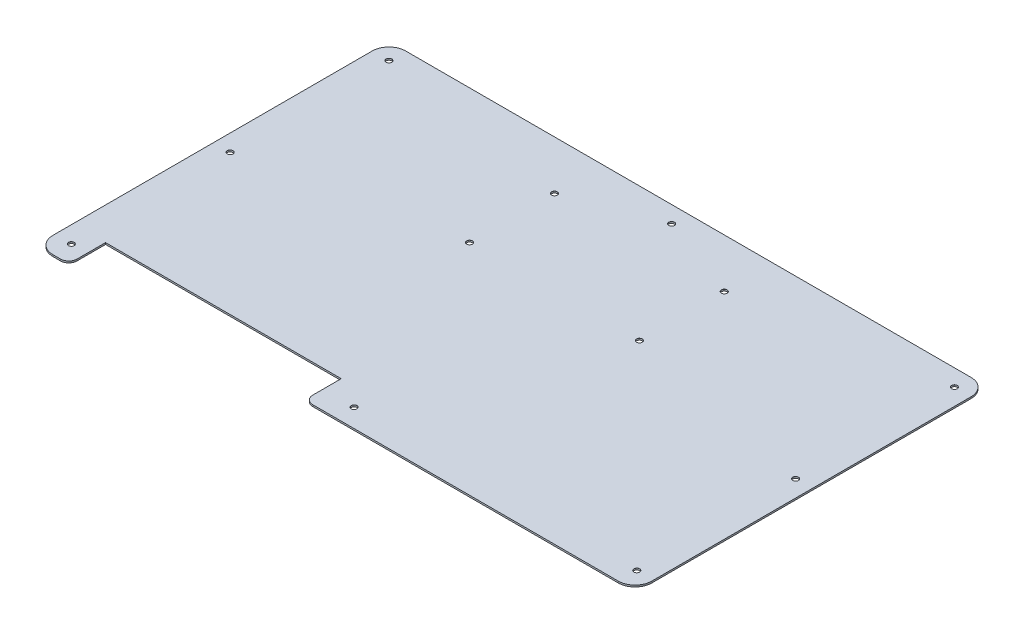
ISO-10303-21;
HEADER;
FILE_DESCRIPTION(('STEP AP214'),'2;1');
FILE_NAME('part.step','',(''),(''),'','','');
FILE_SCHEMA(('AUTOMOTIVE_DESIGN { 1 0 10303 214 1 1 1 1 }'));
ENDSEC;
DATA;
#1=APPLICATION_CONTEXT('core data for automotive mechanical design processes');
#2=APPLICATION_PROTOCOL_DEFINITION('international standard','automotive_design',2000,#1);
#3=PRODUCT_CONTEXT('',#1,'mechanical');
#4=PRODUCT('Part','Part','',(#3));
#5=PRODUCT_RELATED_PRODUCT_CATEGORY('part','',(#4));
#6=PRODUCT_DEFINITION_FORMATION('','',#4);
#7=PRODUCT_DEFINITION_CONTEXT('part definition',#1,'design');
#8=PRODUCT_DEFINITION('design','',#6,#7);
#9=PRODUCT_DEFINITION_SHAPE('','',#8);
#10=(LENGTH_UNIT() NAMED_UNIT(*) SI_UNIT(.MILLI.,.METRE.));
#11=(NAMED_UNIT(*) PLANE_ANGLE_UNIT() SI_UNIT($,.RADIAN.));
#12=(NAMED_UNIT(*) SI_UNIT($,.STERADIAN.) SOLID_ANGLE_UNIT());
#13=UNCERTAINTY_MEASURE_WITH_UNIT(LENGTH_MEASURE(1.E-05),#10,'distance_accuracy_value','');
#14=(GEOMETRIC_REPRESENTATION_CONTEXT(3) GLOBAL_UNCERTAINTY_ASSIGNED_CONTEXT((#13)) GLOBAL_UNIT_ASSIGNED_CONTEXT((#10,
#11,#12)) REPRESENTATION_CONTEXT('',''));
#15=CARTESIAN_POINT('',(0.,0.,0.));
#16=DIRECTION('',(0.,0.,1.));
#17=DIRECTION('',(1.,0.,0.));
#18=AXIS2_PLACEMENT_3D('',#15,#16,#17);
#19=CARTESIAN_POINT('',(-18.635,1.,105.525));
#20=DIRECTION('',(0.,0.,-1.));
#21=DIRECTION('',(-1.,0.,0.));
#22=AXIS2_PLACEMENT_3D('',#19,#20,#21);
#23=PLANE('',#22);
#24=DIRECTION('',(1.,0.,0.));
#25=VECTOR('',#24,1.);
#26=CARTESIAN_POINT('',(-18.635,1.,105.525));
#27=LINE('',#26,#25);
#28=CARTESIAN_POINT('',(-13.635,1.,105.525));
#29=VERTEX_POINT('',#28);
#30=CARTESIAN_POINT('',(169.135,1.,105.525));
#31=VERTEX_POINT('',#30);
#32=EDGE_CURVE('E188',#29,#31,#27,.T.);
#33=ORIENTED_EDGE('',*,*,#32,.F.);
#34=DIRECTION('',(0.,-1.,0.));
#35=VECTOR('',#34,1.);
#36=CARTESIAN_POINT('',(-13.635,1.,105.525));
#37=LINE('',#36,#35);
#38=CARTESIAN_POINT('',(-13.635,0.,105.525));
#39=VERTEX_POINT('',#38);
#40=EDGE_CURVE('E247',#29,#39,#37,.T.);
#41=ORIENTED_EDGE('',*,*,#40,.T.);
#42=DIRECTION('',(1.,0.,0.));
#43=VECTOR('',#42,1.);
#44=CARTESIAN_POINT('',(-18.635,0.,105.525));
#45=LINE('',#44,#43);
#46=CARTESIAN_POINT('',(169.135,0.,105.525));
#47=VERTEX_POINT('',#46);
#48=EDGE_CURVE('E177',#39,#47,#45,.T.);
#49=ORIENTED_EDGE('',*,*,#48,.T.);
#50=DIRECTION('',(0.,-1.,0.));
#51=VECTOR('',#50,1.);
#52=CARTESIAN_POINT('',(169.135,1.,105.525));
#53=LINE('',#52,#51);
#54=EDGE_CURVE('E244',#47,#31,#53,.F.);
#55=ORIENTED_EDGE('',*,*,#54,.T.);
#56=EDGE_LOOP('',(#33,#41,#49,#55));
#57=FACE_BOUND('',#56,.T.);
#58=ADVANCED_FACE('F44',(#57),#23,.F.);
#59=CARTESIAN_POINT('',(179.135,1.,-105.525));
#60=DIRECTION('',(-1.,0.,0.));
#61=DIRECTION('',(0.,0.,1.));
#62=AXIS2_PLACEMENT_3D('',#59,#60,#61);
#63=PLANE('',#62);
#64=DIRECTION('',(0.,0.,-1.));
#65=VECTOR('',#64,1.);
#66=CARTESIAN_POINT('',(179.135,0.,-105.525));
#67=LINE('',#66,#65);
#68=CARTESIAN_POINT('',(179.135,0.,95.525));
#69=VERTEX_POINT('',#68);
#70=CARTESIAN_POINT('',(179.135,0.,-95.525));
#71=VERTEX_POINT('',#70);
#72=EDGE_CURVE('E306',#69,#71,#67,.T.);
#73=ORIENTED_EDGE('',*,*,#72,.T.);
#74=DIRECTION('',(0.,-1.,0.));
#75=VECTOR('',#74,1.);
#76=CARTESIAN_POINT('',(179.135,1.,-95.525));
#77=LINE('',#76,#75);
#78=CARTESIAN_POINT('',(179.135,1.,-95.525));
#79=VERTEX_POINT('',#78);
#80=EDGE_CURVE('E242',#71,#79,#77,.F.);
#81=ORIENTED_EDGE('',*,*,#80,.T.);
#82=DIRECTION('',(0.,0.,-1.));
#83=VECTOR('',#82,1.);
#84=CARTESIAN_POINT('',(179.135,1.,-105.525));
#85=LINE('',#84,#83);
#86=CARTESIAN_POINT('',(179.135,1.,95.525));
#87=VERTEX_POINT('',#86);
#88=EDGE_CURVE('E192',#87,#79,#85,.T.);
#89=ORIENTED_EDGE('',*,*,#88,.F.);
#90=DIRECTION('',(0.,-1.,0.));
#91=VECTOR('',#90,1.);
#92=CARTESIAN_POINT('',(179.135,1.,95.525));
#93=LINE('',#92,#91);
#94=EDGE_CURVE('E239',#87,#69,#93,.T.);
#95=ORIENTED_EDGE('',*,*,#94,.T.);
#96=EDGE_LOOP('',(#73,#81,#89,#95));
#97=FACE_BOUND('',#96,.T.);
#98=ADVANCED_FACE('F302',(#97),#63,.F.);
#99=CARTESIAN_POINT('',(-179.135,1.,-105.525));
#100=DIRECTION('',(0.,0.,1.));
#101=DIRECTION('',(1.,0.,0.));
#102=AXIS2_PLACEMENT_3D('',#99,#100,#101);
#103=PLANE('',#102);
#104=DIRECTION('',(-1.,0.,0.));
#105=VECTOR('',#104,1.);
#106=CARTESIAN_POINT('',(-179.135,0.,-105.525));
#107=LINE('',#106,#105);
#108=CARTESIAN_POINT('',(169.135,0.,-105.525));
#109=VERTEX_POINT('',#108);
#110=CARTESIAN_POINT('',(-169.135,0.,-105.525));
#111=VERTEX_POINT('',#110);
#112=EDGE_CURVE('E308',#109,#111,#107,.T.);
#113=ORIENTED_EDGE('',*,*,#112,.T.);
#114=DIRECTION('',(0.,-1.,0.));
#115=VECTOR('',#114,1.);
#116=CARTESIAN_POINT('',(-169.135,1.,-105.525));
#117=LINE('',#116,#115);
#118=CARTESIAN_POINT('',(-169.135,1.,-105.525));
#119=VERTEX_POINT('',#118);
#120=EDGE_CURVE('E291',#111,#119,#117,.F.);
#121=ORIENTED_EDGE('',*,*,#120,.T.);
#122=DIRECTION('',(-1.,0.,0.));
#123=VECTOR('',#122,1.);
#124=CARTESIAN_POINT('',(-179.135,1.,-105.525));
#125=LINE('',#124,#123);
#126=CARTESIAN_POINT('',(169.135,1.,-105.525));
#127=VERTEX_POINT('',#126);
#128=EDGE_CURVE('E200',#127,#119,#125,.T.);
#129=ORIENTED_EDGE('',*,*,#128,.F.);
#130=DIRECTION('',(0.,-1.,0.));
#131=VECTOR('',#130,1.);
#132=CARTESIAN_POINT('',(169.135,1.,-105.525));
#133=LINE('',#132,#131);
#134=EDGE_CURVE('E288',#127,#109,#133,.T.);
#135=ORIENTED_EDGE('',*,*,#134,.T.);
#136=EDGE_LOOP('',(#113,#121,#129,#135));
#137=FACE_BOUND('',#136,.T.);
#138=ADVANCED_FACE('F330',(#137),#103,.F.);
#139=CARTESIAN_POINT('',(-179.135,1.,-105.525));
#140=DIRECTION('',(1.,0.,0.));
#141=DIRECTION('',(0.,0.,-1.));
#142=AXIS2_PLACEMENT_3D('',#139,#140,#141);
#143=PLANE('',#142);
#144=DIRECTION('',(0.,0.,1.));
#145=VECTOR('',#144,1.);
#146=CARTESIAN_POINT('',(-179.135,1.,-105.525));
#147=LINE('',#146,#145);
#148=CARTESIAN_POINT('',(-179.135,1.,-95.525));
#149=VERTEX_POINT('',#148);
#150=CARTESIAN_POINT('',(-179.135,1.,95.525));
#151=VERTEX_POINT('',#150);
#152=EDGE_CURVE('E205',#149,#151,#147,.T.);
#153=ORIENTED_EDGE('',*,*,#152,.F.);
#154=DIRECTION('',(0.,-1.,0.));
#155=VECTOR('',#154,1.);
#156=CARTESIAN_POINT('',(-179.135,1.,-95.525));
#157=LINE('',#156,#155);
#158=CARTESIAN_POINT('',(-179.135,0.,-95.525));
#159=VERTEX_POINT('',#158);
#160=EDGE_CURVE('E277',#149,#159,#157,.T.);
#161=ORIENTED_EDGE('',*,*,#160,.T.);
#162=DIRECTION('',(0.,0.,1.));
#163=VECTOR('',#162,1.);
#164=CARTESIAN_POINT('',(-179.135,0.,-105.525));
#165=LINE('',#164,#163);
#166=CARTESIAN_POINT('',(-179.135,0.,95.525));
#167=VERTEX_POINT('',#166);
#168=EDGE_CURVE('E269',#159,#167,#165,.T.);
#169=ORIENTED_EDGE('',*,*,#168,.T.);
#170=DIRECTION('',(0.,-1.,0.));
#171=VECTOR('',#170,1.);
#172=CARTESIAN_POINT('',(-179.135,1.,95.525));
#173=LINE('',#172,#171);
#174=EDGE_CURVE('E162',#167,#151,#173,.F.);
#175=ORIENTED_EDGE('',*,*,#174,.T.);
#176=EDGE_LOOP('',(#153,#161,#169,#175));
#177=FACE_BOUND('',#176,.T.);
#178=ADVANCED_FACE('F313',(#177),#143,.F.);
#179=CARTESIAN_POINT('',(-179.135,1.,105.525));
#180=DIRECTION('',(0.,0.,-1.));
#181=DIRECTION('',(-1.,0.,0.));
#182=AXIS2_PLACEMENT_3D('',#179,#180,#181);
#183=PLANE('',#182);
#184=DIRECTION('',(1.,0.,0.));
#185=VECTOR('',#184,1.);
#186=CARTESIAN_POINT('',(-179.135,0.,105.525));
#187=LINE('',#186,#185);
#188=CARTESIAN_POINT('',(-169.135,0.,105.525));
#189=VERTEX_POINT('',#188);
#190=CARTESIAN_POINT('',(-164.635,0.,105.525));
#191=VERTEX_POINT('',#190);
#192=EDGE_CURVE('E266',#189,#191,#187,.T.);
#193=ORIENTED_EDGE('',*,*,#192,.T.);
#194=DIRECTION('',(0.,-1.,0.));
#195=VECTOR('',#194,1.);
#196=CARTESIAN_POINT('',(-164.635,1.,105.525));
#197=LINE('',#196,#195);
#198=CARTESIAN_POINT('',(-164.635,1.,105.525));
#199=VERTEX_POINT('',#198);
#200=EDGE_CURVE('E12',#191,#199,#197,.F.);
#201=ORIENTED_EDGE('',*,*,#200,.T.);
#202=DIRECTION('',(1.,0.,0.));
#203=VECTOR('',#202,1.);
#204=CARTESIAN_POINT('',(-179.135,1.,105.525));
#205=LINE('',#204,#203);
#206=CARTESIAN_POINT('',(-169.135,1.,105.525));
#207=VERTEX_POINT('',#206);
#208=EDGE_CURVE('E153',#207,#199,#205,.T.);
#209=ORIENTED_EDGE('',*,*,#208,.F.);
#210=DIRECTION('',(0.,-1.,0.));
#211=VECTOR('',#210,1.);
#212=CARTESIAN_POINT('',(-169.135,1.,105.525));
#213=LINE('',#212,#211);
#214=EDGE_CURVE('E229',#207,#189,#213,.T.);
#215=ORIENTED_EDGE('',*,*,#214,.T.);
#216=EDGE_LOOP('',(#193,#201,#209,#215));
#217=FACE_BOUND('',#216,.T.);
#218=ADVANCED_FACE('F314',(#217),#183,.F.);
#219=CARTESIAN_POINT('',(-159.635,1.,105.525));
#220=DIRECTION('',(-1.,0.,0.));
#221=DIRECTION('',(0.,0.,1.));
#222=AXIS2_PLACEMENT_3D('',#219,#220,#221);
#223=PLANE('',#222);
#224=DIRECTION('',(0.,0.,-1.));
#225=VECTOR('',#224,1.);
#226=CARTESIAN_POINT('',(-159.635,1.,105.525));
#227=LINE('',#226,#225);
#228=CARTESIAN_POINT('',(-159.635,1.,100.525));
#229=VERTEX_POINT('',#228);
#230=CARTESIAN_POINT('',(-159.635,1.,83.525));
#231=VERTEX_POINT('',#230);
#232=EDGE_CURVE('E142',#229,#231,#227,.T.);
#233=ORIENTED_EDGE('',*,*,#232,.F.);
#234=DIRECTION('',(0.,-1.,0.));
#235=VECTOR('',#234,1.);
#236=CARTESIAN_POINT('',(-159.635,1.,100.525));
#237=LINE('',#236,#235);
#238=CARTESIAN_POINT('',(-159.635,0.,100.525));
#239=VERTEX_POINT('',#238);
#240=EDGE_CURVE('E52',#229,#239,#237,.T.);
#241=ORIENTED_EDGE('',*,*,#240,.T.);
#242=DIRECTION('',(0.,0.,-1.));
#243=VECTOR('',#242,1.);
#244=CARTESIAN_POINT('',(-159.635,0.,105.525));
#245=LINE('',#244,#243);
#246=CARTESIAN_POINT('',(-159.635,0.,83.525));
#247=VERTEX_POINT('',#246);
#248=EDGE_CURVE('E159',#239,#247,#245,.T.);
#249=ORIENTED_EDGE('',*,*,#248,.T.);
#250=DIRECTION('',(0.,-1.,0.));
#251=VECTOR('',#250,1.);
#252=CARTESIAN_POINT('',(-159.635,1.,83.525));
#253=LINE('',#252,#251);
#254=EDGE_CURVE('E156',#231,#247,#253,.T.);
#255=ORIENTED_EDGE('',*,*,#254,.F.);
#256=EDGE_LOOP('',(#233,#241,#249,#255));
#257=FACE_BOUND('',#256,.T.);
#258=ADVANCED_FACE('F157',(#257),#223,.F.);
#259=CARTESIAN_POINT('',(-159.635,1.,83.525));
#260=DIRECTION('',(0.,0.,-1.));
#261=DIRECTION('',(-1.,0.,0.));
#262=AXIS2_PLACEMENT_3D('',#259,#260,#261);
#263=PLANE('',#262);
#264=DIRECTION('',(1.,0.,0.));
#265=VECTOR('',#264,1.);
#266=CARTESIAN_POINT('',(-159.635,0.,83.525));
#267=LINE('',#266,#265);
#268=CARTESIAN_POINT('',(-18.635,0.,83.525));
#269=VERTEX_POINT('',#268);
#270=EDGE_CURVE('E265',#247,#269,#267,.T.);
#271=ORIENTED_EDGE('',*,*,#270,.T.);
#272=DIRECTION('',(0.,-1.,0.));
#273=VECTOR('',#272,1.);
#274=CARTESIAN_POINT('',(-18.635,1.,83.525));
#275=LINE('',#274,#273);
#276=CARTESIAN_POINT('',(-18.635,1.,83.525));
#277=VERTEX_POINT('',#276);
#278=EDGE_CURVE('E163',#277,#269,#275,.T.);
#279=ORIENTED_EDGE('',*,*,#278,.F.);
#280=DIRECTION('',(1.,0.,0.));
#281=VECTOR('',#280,1.);
#282=CARTESIAN_POINT('',(-159.635,1.,83.525));
#283=LINE('',#282,#281);
#284=EDGE_CURVE('E147',#231,#277,#283,.T.);
#285=ORIENTED_EDGE('',*,*,#284,.F.);
#286=ORIENTED_EDGE('',*,*,#254,.T.);
#287=EDGE_LOOP('',(#271,#279,#285,#286));
#288=FACE_BOUND('',#287,.T.);
#289=ADVANCED_FACE('F165',(#288),#263,.F.);
#290=CARTESIAN_POINT('',(-18.635,1.,83.525));
#291=DIRECTION('',(1.,0.,0.));
#292=DIRECTION('',(0.,0.,-1.));
#293=AXIS2_PLACEMENT_3D('',#290,#291,#292);
#294=PLANE('',#293);
#295=DIRECTION('',(0.,0.,1.));
#296=VECTOR('',#295,1.);
#297=CARTESIAN_POINT('',(-18.635,0.,83.525));
#298=LINE('',#297,#296);
#299=CARTESIAN_POINT('',(-18.635,0.,100.525));
#300=VERTEX_POINT('',#299);
#301=EDGE_CURVE('E193',#269,#300,#298,.T.);
#302=ORIENTED_EDGE('',*,*,#301,.T.);
#303=DIRECTION('',(0.,-1.,0.));
#304=VECTOR('',#303,1.);
#305=CARTESIAN_POINT('',(-18.635,1.,100.525));
#306=LINE('',#305,#304);
#307=CARTESIAN_POINT('',(-18.635,1.,100.525));
#308=VERTEX_POINT('',#307);
#309=EDGE_CURVE('E254',#300,#308,#306,.F.);
#310=ORIENTED_EDGE('',*,*,#309,.T.);
#311=DIRECTION('',(0.,0.,1.));
#312=VECTOR('',#311,1.);
#313=CARTESIAN_POINT('',(-18.635,1.,83.525));
#314=LINE('',#313,#312);
#315=EDGE_CURVE('E169',#277,#308,#314,.T.);
#316=ORIENTED_EDGE('',*,*,#315,.F.);
#317=ORIENTED_EDGE('',*,*,#278,.T.);
#318=EDGE_LOOP('',(#302,#310,#316,#317));
#319=FACE_BOUND('',#318,.T.);
#320=ADVANCED_FACE('F364',(#319),#294,.F.);
#321=CARTESIAN_POINT('',(0.,1.,0.));
#322=DIRECTION('',(0.,-1.,0.));
#323=DIRECTION('',(0.,0.,-1.));
#324=AXIS2_PLACEMENT_3D('',#321,#322,#323);
#325=PLANE('',#324);
#326=CARTESIAN_POINT('',(50.8,1.,-76.2));
#327=DIRECTION('',(0.,1.,0.));
#328=DIRECTION('',(0.,0.,1.));
#329=AXIS2_PLACEMENT_3D('',#326,#327,#328);
#330=CIRCLE('',#329,1.725);
#331=CARTESIAN_POINT('',(50.8,1.,-74.475));
#332=VERTEX_POINT('',#331);
#333=EDGE_CURVE('E705',#332,#332,#330,.T.);
#334=ORIENTED_EDGE('',*,*,#333,.F.);
#335=EDGE_LOOP('',(#334));
#336=FACE_BOUND('',#335,.T.);
#337=CARTESIAN_POINT('',(-50.8,1.,-25.4));
#338=DIRECTION('',(0.,1.,0.));
#339=DIRECTION('',(0.,0.,1.));
#340=AXIS2_PLACEMENT_3D('',#337,#338,#339);
#341=CIRCLE('',#340,1.725);
#342=CARTESIAN_POINT('',(-50.8,1.,-23.675));
#343=VERTEX_POINT('',#342);
#344=EDGE_CURVE('E719',#343,#343,#341,.T.);
#345=ORIENTED_EDGE('',*,*,#344,.F.);
#346=EDGE_LOOP('',(#345));
#347=FACE_BOUND('',#346,.T.);
#348=CARTESIAN_POINT('',(-50.8,1.,-76.2));
#349=DIRECTION('',(0.,1.,0.));
#350=DIRECTION('',(0.,0.,1.));
#351=AXIS2_PLACEMENT_3D('',#348,#349,#350);
#352=CIRCLE('',#351,1.725);
#353=CARTESIAN_POINT('',(-50.8,1.,-74.475));
#354=VERTEX_POINT('',#353);
#355=EDGE_CURVE('E728',#354,#354,#352,.T.);
#356=ORIENTED_EDGE('',*,*,#355,.F.);
#357=EDGE_LOOP('',(#356));
#358=FACE_BOUND('',#357,.T.);
#359=CARTESIAN_POINT('',(50.8,1.,-25.4));
#360=DIRECTION('',(0.,1.,0.));
#361=DIRECTION('',(0.,0.,1.));
#362=AXIS2_PLACEMENT_3D('',#359,#360,#361);
#363=CIRCLE('',#362,1.725);
#364=CARTESIAN_POINT('',(50.8,1.,-23.675));
#365=VERTEX_POINT('',#364);
#366=EDGE_CURVE('E739',#365,#365,#363,.T.);
#367=ORIENTED_EDGE('',*,*,#366,.F.);
#368=EDGE_LOOP('',(#367));
#369=FACE_BOUND('',#368,.T.);
#370=CARTESIAN_POINT('',(169.135,1.,-0.524999999999845));
#371=DIRECTION('',(0.,1.,0.));
#372=DIRECTION('',(0.,0.,1.));
#373=AXIS2_PLACEMENT_3D('',#370,#371,#372);
#374=CIRCLE('',#373,1.725);
#375=CARTESIAN_POINT('',(169.135,1.,1.20000000000016));
#376=VERTEX_POINT('',#375);
#377=EDGE_CURVE('E751',#376,#376,#374,.T.);
#378=ORIENTED_EDGE('',*,*,#377,.F.);
#379=EDGE_LOOP('',(#378));
#380=FACE_BOUND('',#379,.T.);
#381=CARTESIAN_POINT('',(169.135,1.,94.4750000000001));
#382=DIRECTION('',(0.,1.,0.));
#383=DIRECTION('',(0.,0.,1.));
#384=AXIS2_PLACEMENT_3D('',#381,#382,#383);
#385=CIRCLE('',#384,1.725);
#386=CARTESIAN_POINT('',(169.135,1.,96.2000000000001));
#387=VERTEX_POINT('',#386);
#388=EDGE_CURVE('E762',#387,#387,#385,.T.);
#389=ORIENTED_EDGE('',*,*,#388,.F.);
#390=EDGE_LOOP('',(#389));
#391=FACE_BOUND('',#390,.T.);
#392=CARTESIAN_POINT('',(169.135,1.,-95.5249999999999));
#393=DIRECTION('',(0.,1.,0.));
#394=DIRECTION('',(0.,0.,1.));
#395=AXIS2_PLACEMENT_3D('',#392,#393,#394);
#396=CIRCLE('',#395,1.725);
#397=CARTESIAN_POINT('',(169.135,1.,-93.7999999999999));
#398=VERTEX_POINT('',#397);
#399=EDGE_CURVE('E773',#398,#398,#396,.T.);
#400=ORIENTED_EDGE('',*,*,#399,.F.);
#401=EDGE_LOOP('',(#400));
#402=FACE_BOUND('',#401,.T.);
#403=CARTESIAN_POINT('',(0.,1.,-95.5249999999999));
#404=DIRECTION('',(0.,1.,0.));
#405=DIRECTION('',(0.,0.,1.));
#406=AXIS2_PLACEMENT_3D('',#403,#404,#405);
#407=CIRCLE('',#406,1.725);
#408=CARTESIAN_POINT('',(0.,1.,-93.7999999999999));
#409=VERTEX_POINT('',#408);
#410=EDGE_CURVE('E785',#409,#409,#407,.T.);
#411=ORIENTED_EDGE('',*,*,#410,.F.);
#412=EDGE_LOOP('',(#411));
#413=FACE_BOUND('',#412,.T.);
#414=CARTESIAN_POINT('',(-169.135,1.,-95.525));
#415=DIRECTION('',(0.,1.,0.));
#416=DIRECTION('',(0.,0.,1.));
#417=AXIS2_PLACEMENT_3D('',#414,#415,#416);
#418=CIRCLE('',#417,1.725);
#419=CARTESIAN_POINT('',(-169.135,1.,-93.8));
#420=VERTEX_POINT('',#419);
#421=EDGE_CURVE('E796',#420,#420,#418,.T.);
#422=ORIENTED_EDGE('',*,*,#421,.F.);
#423=EDGE_LOOP('',(#422));
#424=FACE_BOUND('',#423,.T.);
#425=CARTESIAN_POINT('',(-169.135,1.,-0.524999999999928));
#426=DIRECTION('',(0.,1.,0.));
#427=DIRECTION('',(0.,0.,1.));
#428=AXIS2_PLACEMENT_3D('',#425,#426,#427);
#429=CIRCLE('',#428,1.725);
#430=CARTESIAN_POINT('',(-169.135,1.,1.20000000000008));
#431=VERTEX_POINT('',#430);
#432=EDGE_CURVE('E807',#431,#431,#429,.T.);
#433=ORIENTED_EDGE('',*,*,#432,.F.);
#434=EDGE_LOOP('',(#433));
#435=FACE_BOUND('',#434,.T.);
#436=CARTESIAN_POINT('',(-169.135,1.,94.4750000000001));
#437=DIRECTION('',(0.,1.,0.));
#438=DIRECTION('',(0.,0.,1.));
#439=AXIS2_PLACEMENT_3D('',#436,#437,#438);
#440=CIRCLE('',#439,1.725);
#441=CARTESIAN_POINT('',(-169.135,1.,96.2000000000001));
#442=VERTEX_POINT('',#441);
#443=EDGE_CURVE('E815',#442,#442,#440,.T.);
#444=ORIENTED_EDGE('',*,*,#443,.F.);
#445=EDGE_LOOP('',(#444));
#446=FACE_BOUND('',#445,.T.);
#447=CARTESIAN_POINT('',(0.,1.,94.4750000000001));
#448=DIRECTION('',(0.,1.,0.));
#449=DIRECTION('',(0.,0.,1.));
#450=AXIS2_PLACEMENT_3D('',#447,#448,#449);
#451=CIRCLE('',#450,1.725);
#452=CARTESIAN_POINT('',(0.,1.,96.2000000000001));
#453=VERTEX_POINT('',#452);
#454=EDGE_CURVE('E826',#453,#453,#451,.T.);
#455=ORIENTED_EDGE('',*,*,#454,.F.);
#456=EDGE_LOOP('',(#455));
#457=FACE_BOUND('',#456,.T.);
#458=ORIENTED_EDGE('',*,*,#315,.T.);
#459=CARTESIAN_POINT('',(-13.635,1.,100.525));
#460=DIRECTION('',(0.,-1.,0.));
#461=DIRECTION('',(0.,0.,-1.));
#462=AXIS2_PLACEMENT_3D('',#459,#460,#461);
#463=CIRCLE('',#462,5.);
#464=EDGE_CURVE('E257',#308,#29,#463,.F.);
#465=ORIENTED_EDGE('',*,*,#464,.T.);
#466=ORIENTED_EDGE('',*,*,#32,.T.);
#467=CARTESIAN_POINT('',(169.135,1.,95.525));
#468=DIRECTION('',(0.,-1.,0.));
#469=DIRECTION('',(0.,0.,-1.));
#470=AXIS2_PLACEMENT_3D('',#467,#468,#469);
#471=CIRCLE('',#470,10.);
#472=EDGE_CURVE('E234',#31,#87,#471,.F.);
#473=ORIENTED_EDGE('',*,*,#472,.T.);
#474=ORIENTED_EDGE('',*,*,#88,.T.);
#475=CARTESIAN_POINT('',(169.135,1.,-95.525));
#476=DIRECTION('',(0.,-1.,0.));
#477=DIRECTION('',(0.,0.,-1.));
#478=AXIS2_PLACEMENT_3D('',#475,#476,#477);
#479=CIRCLE('',#478,10.);
#480=EDGE_CURVE('E230',#79,#127,#479,.F.);
#481=ORIENTED_EDGE('',*,*,#480,.T.);
#482=ORIENTED_EDGE('',*,*,#128,.T.);
#483=CARTESIAN_POINT('',(-169.135,1.,-95.525));
#484=DIRECTION('',(0.,-1.,0.));
#485=DIRECTION('',(0.,0.,-1.));
#486=AXIS2_PLACEMENT_3D('',#483,#484,#485);
#487=CIRCLE('',#486,10.);
#488=EDGE_CURVE('E220',#119,#149,#487,.F.);
#489=ORIENTED_EDGE('',*,*,#488,.T.);
#490=ORIENTED_EDGE('',*,*,#152,.T.);
#491=CARTESIAN_POINT('',(-169.135,1.,95.525));
#492=DIRECTION('',(0.,-1.,0.));
#493=DIRECTION('',(0.,0.,-1.));
#494=AXIS2_PLACEMENT_3D('',#491,#492,#493);
#495=CIRCLE('',#494,10.);
#496=EDGE_CURVE('E218',#151,#207,#495,.F.);
#497=ORIENTED_EDGE('',*,*,#496,.T.);
#498=ORIENTED_EDGE('',*,*,#208,.T.);
#499=CARTESIAN_POINT('',(-164.635,1.,100.525));
#500=DIRECTION('',(0.,-1.,0.));
#501=DIRECTION('',(0.,0.,-1.));
#502=AXIS2_PLACEMENT_3D('',#499,#500,#501);
#503=CIRCLE('',#502,5.);
#504=EDGE_CURVE('E59',#199,#229,#503,.F.);
#505=ORIENTED_EDGE('',*,*,#504,.T.);
#506=ORIENTED_EDGE('',*,*,#232,.T.);
#507=ORIENTED_EDGE('',*,*,#284,.T.);
#508=EDGE_LOOP('',(#458,#465,#466,#473,#474,#481,#482,#489,#490,#497,#498,#505,#506,#507));
#509=FACE_BOUND('',#508,.T.);
#510=ADVANCED_FACE('F145',(#336,#347,#358,#369,#380,#391,#402,#413,#424,#435,#446,#457,#509),
#325,.F.);
#511=CARTESIAN_POINT('',(0.,0.,0.));
#512=DIRECTION('',(0.,-1.,0.));
#513=DIRECTION('',(0.,0.,-1.));
#514=AXIS2_PLACEMENT_3D('',#511,#512,#513);
#515=PLANE('',#514);
#516=CARTESIAN_POINT('',(50.8,0.,-76.2));
#517=DIRECTION('',(0.,1.,0.));
#518=DIRECTION('',(0.,0.,1.));
#519=AXIS2_PLACEMENT_3D('',#516,#517,#518);
#520=CIRCLE('',#519,1.69999999999999);
#521=CARTESIAN_POINT('',(50.8,0.,-74.5));
#522=VERTEX_POINT('',#521);
#523=EDGE_CURVE('E709',#522,#522,#520,.T.);
#524=ORIENTED_EDGE('',*,*,#523,.T.);
#525=EDGE_LOOP('',(#524));
#526=FACE_BOUND('',#525,.T.);
#527=CARTESIAN_POINT('',(-50.8,0.,-25.4));
#528=DIRECTION('',(0.,1.,0.));
#529=DIRECTION('',(0.,0.,1.));
#530=AXIS2_PLACEMENT_3D('',#527,#528,#529);
#531=CIRCLE('',#530,1.69999999999999);
#532=CARTESIAN_POINT('',(-50.8,0.,-23.7));
#533=VERTEX_POINT('',#532);
#534=EDGE_CURVE('E726',#533,#533,#531,.T.);
#535=ORIENTED_EDGE('',*,*,#534,.T.);
#536=EDGE_LOOP('',(#535));
#537=FACE_BOUND('',#536,.T.);
#538=CARTESIAN_POINT('',(-50.8,0.,-76.2));
#539=DIRECTION('',(0.,1.,0.));
#540=DIRECTION('',(0.,0.,1.));
#541=AXIS2_PLACEMENT_3D('',#538,#539,#540);
#542=CIRCLE('',#541,1.69999999999999);
#543=CARTESIAN_POINT('',(-50.8,0.,-74.5));
#544=VERTEX_POINT('',#543);
#545=EDGE_CURVE('E736',#544,#544,#542,.T.);
#546=ORIENTED_EDGE('',*,*,#545,.T.);
#547=EDGE_LOOP('',(#546));
#548=FACE_BOUND('',#547,.T.);
#549=CARTESIAN_POINT('',(50.8,0.,-25.4));
#550=DIRECTION('',(0.,1.,0.));
#551=DIRECTION('',(0.,0.,1.));
#552=AXIS2_PLACEMENT_3D('',#549,#550,#551);
#553=CIRCLE('',#552,1.69999999999999);
#554=CARTESIAN_POINT('',(50.8,0.,-23.7));
#555=VERTEX_POINT('',#554);
#556=EDGE_CURVE('E757',#555,#555,#553,.T.);
#557=ORIENTED_EDGE('',*,*,#556,.T.);
#558=EDGE_LOOP('',(#557));
#559=FACE_BOUND('',#558,.T.);
#560=CARTESIAN_POINT('',(169.135,0.,-0.524999999999845));
#561=DIRECTION('',(0.,1.,0.));
#562=DIRECTION('',(0.,0.,1.));
#563=AXIS2_PLACEMENT_3D('',#560,#561,#562);
#564=CIRCLE('',#563,1.70000000000001);
#565=CARTESIAN_POINT('',(169.135,0.,1.17500000000016));
#566=VERTEX_POINT('',#565);
#567=EDGE_CURVE('E760',#566,#566,#564,.T.);
#568=ORIENTED_EDGE('',*,*,#567,.T.);
#569=EDGE_LOOP('',(#568));
#570=FACE_BOUND('',#569,.T.);
#571=CARTESIAN_POINT('',(169.135,0.,94.4750000000001));
#572=DIRECTION('',(0.,1.,0.));
#573=DIRECTION('',(0.,0.,1.));
#574=AXIS2_PLACEMENT_3D('',#571,#572,#573);
#575=CIRCLE('',#574,1.70000000000001);
#576=CARTESIAN_POINT('',(169.135,0.,96.1750000000002));
#577=VERTEX_POINT('',#576);
#578=EDGE_CURVE('E770',#577,#577,#575,.T.);
#579=ORIENTED_EDGE('',*,*,#578,.T.);
#580=EDGE_LOOP('',(#579));
#581=FACE_BOUND('',#580,.T.);
#582=CARTESIAN_POINT('',(169.135,0.,-95.5249999999999));
#583=DIRECTION('',(0.,1.,0.));
#584=DIRECTION('',(0.,0.,1.));
#585=AXIS2_PLACEMENT_3D('',#582,#583,#584);
#586=CIRCLE('',#585,1.70000000000001);
#587=CARTESIAN_POINT('',(169.135,0.,-93.8249999999999));
#588=VERTEX_POINT('',#587);
#589=EDGE_CURVE('E791',#588,#588,#586,.T.);
#590=ORIENTED_EDGE('',*,*,#589,.T.);
#591=EDGE_LOOP('',(#590));
#592=FACE_BOUND('',#591,.T.);
#593=CARTESIAN_POINT('',(0.,0.,-95.5249999999999));
#594=DIRECTION('',(0.,1.,0.));
#595=DIRECTION('',(0.,0.,1.));
#596=AXIS2_PLACEMENT_3D('',#593,#594,#595);
#597=CIRCLE('',#596,1.7);
#598=CARTESIAN_POINT('',(0.,0.,-93.8249999999999));
#599=VERTEX_POINT('',#598);
#600=EDGE_CURVE('E794',#599,#599,#597,.T.);
#601=ORIENTED_EDGE('',*,*,#600,.T.);
#602=EDGE_LOOP('',(#601));
#603=FACE_BOUND('',#602,.T.);
#604=CARTESIAN_POINT('',(-169.135,0.,-95.525));
#605=DIRECTION('',(0.,1.,0.));
#606=DIRECTION('',(0.,0.,1.));
#607=AXIS2_PLACEMENT_3D('',#604,#605,#606);
#608=CIRCLE('',#607,1.70000000000001);
#609=CARTESIAN_POINT('',(-169.135,0.,-93.8249999999999));
#610=VERTEX_POINT('',#609);
#611=EDGE_CURVE('E804',#610,#610,#608,.T.);
#612=ORIENTED_EDGE('',*,*,#611,.T.);
#613=EDGE_LOOP('',(#612));
#614=FACE_BOUND('',#613,.T.);
#615=CARTESIAN_POINT('',(-169.135,0.,-0.524999999999928));
#616=DIRECTION('',(0.,1.,0.));
#617=DIRECTION('',(0.,0.,1.));
#618=AXIS2_PLACEMENT_3D('',#615,#616,#617);
#619=CIRCLE('',#618,1.70000000000001);
#620=CARTESIAN_POINT('',(-169.135,0.,1.17500000000008));
#621=VERTEX_POINT('',#620);
#622=EDGE_CURVE('E821',#621,#621,#619,.T.);
#623=ORIENTED_EDGE('',*,*,#622,.T.);
#624=EDGE_LOOP('',(#623));
#625=FACE_BOUND('',#624,.T.);
#626=CARTESIAN_POINT('',(-169.135,0.,94.4750000000001));
#627=DIRECTION('',(0.,1.,0.));
#628=DIRECTION('',(0.,0.,1.));
#629=AXIS2_PLACEMENT_3D('',#626,#627,#628);
#630=CIRCLE('',#629,1.70000000000001);
#631=CARTESIAN_POINT('',(-169.135,0.,96.1750000000001));
#632=VERTEX_POINT('',#631);
#633=EDGE_CURVE('E824',#632,#632,#630,.T.);
#634=ORIENTED_EDGE('',*,*,#633,.T.);
#635=EDGE_LOOP('',(#634));
#636=FACE_BOUND('',#635,.T.);
#637=CARTESIAN_POINT('',(0.,0.,94.4750000000001));
#638=DIRECTION('',(0.,1.,0.));
#639=DIRECTION('',(0.,0.,1.));
#640=AXIS2_PLACEMENT_3D('',#637,#638,#639);
#641=CIRCLE('',#640,1.7);
#642=CARTESIAN_POINT('',(0.,0.,96.1750000000001));
#643=VERTEX_POINT('',#642);
#644=EDGE_CURVE('E194',#643,#643,#641,.T.);
#645=ORIENTED_EDGE('',*,*,#644,.T.);
#646=EDGE_LOOP('',(#645));
#647=FACE_BOUND('',#646,.T.);
#648=ORIENTED_EDGE('',*,*,#48,.F.);
#649=CARTESIAN_POINT('',(-13.635,0.,100.525));
#650=DIRECTION('',(0.,-1.,0.));
#651=DIRECTION('',(0.,0.,-1.));
#652=AXIS2_PLACEMENT_3D('',#649,#650,#651);
#653=CIRCLE('',#652,5.);
#654=EDGE_CURVE('E252',#39,#300,#653,.T.);
#655=ORIENTED_EDGE('',*,*,#654,.T.);
#656=ORIENTED_EDGE('',*,*,#301,.F.);
#657=ORIENTED_EDGE('',*,*,#270,.F.);
#658=ORIENTED_EDGE('',*,*,#248,.F.);
#659=CARTESIAN_POINT('',(-164.635,0.,100.525));
#660=DIRECTION('',(0.,-1.,0.));
#661=DIRECTION('',(0.,0.,-1.));
#662=AXIS2_PLACEMENT_3D('',#659,#660,#661);
#663=CIRCLE('',#662,5.);
#664=EDGE_CURVE('E250',#239,#191,#663,.T.);
#665=ORIENTED_EDGE('',*,*,#664,.T.);
#666=ORIENTED_EDGE('',*,*,#192,.F.);
#667=CARTESIAN_POINT('',(-169.135,0.,95.525));
#668=DIRECTION('',(0.,-1.,0.));
#669=DIRECTION('',(0.,0.,-1.));
#670=AXIS2_PLACEMENT_3D('',#667,#668,#669);
#671=CIRCLE('',#670,10.);
#672=EDGE_CURVE('E284',#189,#167,#671,.T.);
#673=ORIENTED_EDGE('',*,*,#672,.T.);
#674=ORIENTED_EDGE('',*,*,#168,.F.);
#675=CARTESIAN_POINT('',(-169.135,0.,-95.525));
#676=DIRECTION('',(0.,-1.,0.));
#677=DIRECTION('',(0.,0.,-1.));
#678=AXIS2_PLACEMENT_3D('',#675,#676,#677);
#679=CIRCLE('',#678,10.);
#680=EDGE_CURVE('E286',#159,#111,#679,.T.);
#681=ORIENTED_EDGE('',*,*,#680,.T.);
#682=ORIENTED_EDGE('',*,*,#112,.F.);
#683=CARTESIAN_POINT('',(169.135,0.,-95.525));
#684=DIRECTION('',(0.,-1.,0.));
#685=DIRECTION('',(0.,0.,-1.));
#686=AXIS2_PLACEMENT_3D('',#683,#684,#685);
#687=CIRCLE('',#686,10.);
#688=EDGE_CURVE('E282',#109,#71,#687,.T.);
#689=ORIENTED_EDGE('',*,*,#688,.T.);
#690=ORIENTED_EDGE('',*,*,#72,.F.);
#691=CARTESIAN_POINT('',(169.135,0.,95.525));
#692=DIRECTION('',(0.,-1.,0.));
#693=DIRECTION('',(0.,0.,-1.));
#694=AXIS2_PLACEMENT_3D('',#691,#692,#693);
#695=CIRCLE('',#694,10.);
#696=EDGE_CURVE('E279',#69,#47,#695,.T.);
#697=ORIENTED_EDGE('',*,*,#696,.T.);
#698=EDGE_LOOP('',(#648,#655,#656,#657,#658,#665,#666,#673,#674,#681,#682,#689,#690,#697));
#699=FACE_BOUND('',#698,.T.);
#700=ADVANCED_FACE('F262',(#526,#537,#548,#559,#570,#581,#592,#603,#614,#625,#636,#647,#699),
#515,.T.);
#701=CARTESIAN_POINT('',(-169.135,1.,-95.525));
#702=DIRECTION('',(0.,-1.,0.));
#703=DIRECTION('',(0.,0.,-1.));
#704=AXIS2_PLACEMENT_3D('',#701,#702,#703);
#705=CYLINDRICAL_SURFACE('',#704,10.);
#706=ORIENTED_EDGE('',*,*,#488,.F.);
#707=ORIENTED_EDGE('',*,*,#120,.F.);
#708=ORIENTED_EDGE('',*,*,#680,.F.);
#709=ORIENTED_EDGE('',*,*,#160,.F.);
#710=EDGE_LOOP('',(#706,#707,#708,#709));
#711=FACE_BOUND('',#710,.T.);
#712=ADVANCED_FACE('F334',(#711),#705,.T.);
#713=CARTESIAN_POINT('',(-169.135,1.,95.525));
#714=DIRECTION('',(0.,-1.,0.));
#715=DIRECTION('',(0.,0.,-1.));
#716=AXIS2_PLACEMENT_3D('',#713,#714,#715);
#717=CYLINDRICAL_SURFACE('',#716,10.);
#718=ORIENTED_EDGE('',*,*,#496,.F.);
#719=ORIENTED_EDGE('',*,*,#174,.F.);
#720=ORIENTED_EDGE('',*,*,#672,.F.);
#721=ORIENTED_EDGE('',*,*,#214,.F.);
#722=EDGE_LOOP('',(#718,#719,#720,#721));
#723=FACE_BOUND('',#722,.T.);
#724=ADVANCED_FACE('F227',(#723),#717,.T.);
#725=CARTESIAN_POINT('',(169.135,1.,-95.525));
#726=DIRECTION('',(0.,-1.,0.));
#727=DIRECTION('',(0.,0.,-1.));
#728=AXIS2_PLACEMENT_3D('',#725,#726,#727);
#729=CYLINDRICAL_SURFACE('',#728,10.);
#730=ORIENTED_EDGE('',*,*,#480,.F.);
#731=ORIENTED_EDGE('',*,*,#80,.F.);
#732=ORIENTED_EDGE('',*,*,#688,.F.);
#733=ORIENTED_EDGE('',*,*,#134,.F.);
#734=EDGE_LOOP('',(#730,#731,#732,#733));
#735=FACE_BOUND('',#734,.T.);
#736=ADVANCED_FACE('F340',(#735),#729,.T.);
#737=CARTESIAN_POINT('',(169.135,1.,95.525));
#738=DIRECTION('',(0.,-1.,0.));
#739=DIRECTION('',(0.,0.,-1.));
#740=AXIS2_PLACEMENT_3D('',#737,#738,#739);
#741=CYLINDRICAL_SURFACE('',#740,10.);
#742=ORIENTED_EDGE('',*,*,#472,.F.);
#743=ORIENTED_EDGE('',*,*,#54,.F.);
#744=ORIENTED_EDGE('',*,*,#696,.F.);
#745=ORIENTED_EDGE('',*,*,#94,.F.);
#746=EDGE_LOOP('',(#742,#743,#744,#745));
#747=FACE_BOUND('',#746,.T.);
#748=ADVANCED_FACE('F305',(#747),#741,.T.);
#749=CARTESIAN_POINT('',(0.,1.,94.4750000000001));
#750=DIRECTION('',(0.,1.,0.));
#751=DIRECTION('',(0.,0.,1.));
#752=AXIS2_PLACEMENT_3D('',#749,#750,#751);
#753=CYLINDRICAL_SURFACE('',#752,1.69999999999999);
#754=ORIENTED_EDGE('',*,*,#644,.F.);
#755=EDGE_LOOP('',(#754));
#756=FACE_BOUND('',#755,.T.);
#757=CARTESIAN_POINT('',(0.,0.974999999999975,94.4750000000001));
#758=DIRECTION('',(0.,1.,0.));
#759=DIRECTION('',(0.,0.,1.));
#760=AXIS2_PLACEMENT_3D('',#757,#758,#759);
#761=CIRCLE('',#760,1.69999999999999);
#762=CARTESIAN_POINT('',(0.,0.974999999999975,96.1750000000001));
#763=VERTEX_POINT('',#762);
#764=EDGE_CURVE('E830',#763,#763,#761,.T.);
#765=ORIENTED_EDGE('',*,*,#764,.T.);
#766=EDGE_LOOP('',(#765));
#767=FACE_BOUND('',#766,.T.);
#768=ADVANCED_FACE('F345',(#756,#767),#753,.F.);
#769=CARTESIAN_POINT('',(0.,1.,94.4750000000001));
#770=DIRECTION('',(0.,1.,0.));
#771=DIRECTION('',(0.,0.,1.));
#772=AXIS2_PLACEMENT_3D('',#769,#770,#771);
#773=CONICAL_SURFACE('',#772,1.725,0.785398163397171);
#774=ORIENTED_EDGE('',*,*,#764,.F.);
#775=EDGE_LOOP('',(#774));
#776=FACE_BOUND('',#775,.T.);
#777=ORIENTED_EDGE('',*,*,#454,.T.);
#778=EDGE_LOOP('',(#777));
#779=FACE_BOUND('',#778,.T.);
#780=ADVANCED_FACE('F349',(#776,#779),#773,.F.);
#781=CARTESIAN_POINT('',(-169.135,1.,94.4750000000001));
#782=DIRECTION('',(0.,1.,0.));
#783=DIRECTION('',(0.,0.,1.));
#784=AXIS2_PLACEMENT_3D('',#781,#782,#783);
#785=CYLINDRICAL_SURFACE('',#784,1.69999999999999);
#786=ORIENTED_EDGE('',*,*,#633,.F.);
#787=EDGE_LOOP('',(#786));
#788=FACE_BOUND('',#787,.T.);
#789=CARTESIAN_POINT('',(-169.135,0.974999999999975,94.4750000000001));
#790=DIRECTION('',(0.,1.,0.));
#791=DIRECTION('',(0.,0.,1.));
#792=AXIS2_PLACEMENT_3D('',#789,#790,#791);
#793=CIRCLE('',#792,1.69999999999998);
#794=CARTESIAN_POINT('',(-169.135,0.974999999999975,96.175));
#795=VERTEX_POINT('',#794);
#796=EDGE_CURVE('E820',#795,#795,#793,.T.);
#797=ORIENTED_EDGE('',*,*,#796,.T.);
#798=EDGE_LOOP('',(#797));
#799=FACE_BOUND('',#798,.T.);
#800=ADVANCED_FACE('F355',(#788,#799),#785,.F.);
#801=CARTESIAN_POINT('',(-169.135,1.,94.4750000000001));
#802=DIRECTION('',(0.,1.,0.));
#803=DIRECTION('',(0.,0.,1.));
#804=AXIS2_PLACEMENT_3D('',#801,#802,#803);
#805=CONICAL_SURFACE('',#804,1.725,0.785398163397414);
#806=ORIENTED_EDGE('',*,*,#796,.F.);
#807=EDGE_LOOP('',(#806));
#808=FACE_BOUND('',#807,.T.);
#809=ORIENTED_EDGE('',*,*,#443,.T.);
#810=EDGE_LOOP('',(#809));
#811=FACE_BOUND('',#810,.T.);
#812=ADVANCED_FACE('F433',(#808,#811),#805,.F.);
#813=CARTESIAN_POINT('',(-169.135,1.,-0.524999999999928));
#814=DIRECTION('',(0.,1.,0.));
#815=DIRECTION('',(0.,0.,1.));
#816=AXIS2_PLACEMENT_3D('',#813,#814,#815);
#817=CYLINDRICAL_SURFACE('',#816,1.69999999999999);
#818=ORIENTED_EDGE('',*,*,#622,.F.);
#819=EDGE_LOOP('',(#818));
#820=FACE_BOUND('',#819,.T.);
#821=CARTESIAN_POINT('',(-169.135,0.974999999999975,-0.524999999999928));
#822=DIRECTION('',(0.,1.,0.));
#823=DIRECTION('',(0.,0.,1.));
#824=AXIS2_PLACEMENT_3D('',#821,#822,#823);
#825=CIRCLE('',#824,1.69999999999998);
#826=CARTESIAN_POINT('',(-169.135,0.974999999999975,1.17500000000005));
#827=VERTEX_POINT('',#826);
#828=EDGE_CURVE('E812',#827,#827,#825,.T.);
#829=ORIENTED_EDGE('',*,*,#828,.T.);
#830=EDGE_LOOP('',(#829));
#831=FACE_BOUND('',#830,.T.);
#832=ADVANCED_FACE('F442',(#820,#831),#817,.F.);
#833=CARTESIAN_POINT('',(-169.135,1.,-0.524999999999928));
#834=DIRECTION('',(0.,1.,0.));
#835=DIRECTION('',(0.,0.,1.));
#836=AXIS2_PLACEMENT_3D('',#833,#834,#835);
#837=CONICAL_SURFACE('',#836,1.725,0.785398163397414);
#838=ORIENTED_EDGE('',*,*,#828,.F.);
#839=EDGE_LOOP('',(#838));
#840=FACE_BOUND('',#839,.T.);
#841=ORIENTED_EDGE('',*,*,#432,.T.);
#842=EDGE_LOOP('',(#841));
#843=FACE_BOUND('',#842,.T.);
#844=ADVANCED_FACE('F452',(#840,#843),#837,.F.);
#845=CARTESIAN_POINT('',(-169.135,1.,-95.525));
#846=DIRECTION('',(0.,1.,0.));
#847=DIRECTION('',(0.,0.,1.));
#848=AXIS2_PLACEMENT_3D('',#845,#846,#847);
#849=CYLINDRICAL_SURFACE('',#848,1.69999999999999);
#850=ORIENTED_EDGE('',*,*,#611,.F.);
#851=EDGE_LOOP('',(#850));
#852=FACE_BOUND('',#851,.T.);
#853=CARTESIAN_POINT('',(-169.135,0.974999999999975,-95.525));
#854=DIRECTION('',(0.,1.,0.));
#855=DIRECTION('',(0.,0.,1.));
#856=AXIS2_PLACEMENT_3D('',#853,#854,#855);
#857=CIRCLE('',#856,1.69999999999998);
#858=CARTESIAN_POINT('',(-169.135,0.974999999999975,-93.825));
#859=VERTEX_POINT('',#858);
#860=EDGE_CURVE('E801',#859,#859,#857,.T.);
#861=ORIENTED_EDGE('',*,*,#860,.T.);
#862=EDGE_LOOP('',(#861));
#863=FACE_BOUND('',#862,.T.);
#864=ADVANCED_FACE('F462',(#852,#863),#849,.F.);
#865=CARTESIAN_POINT('',(-169.135,1.,-95.525));
#866=DIRECTION('',(0.,1.,0.));
#867=DIRECTION('',(0.,0.,1.));
#868=AXIS2_PLACEMENT_3D('',#865,#866,#867);
#869=CONICAL_SURFACE('',#868,1.725,0.785398163397414);
#870=ORIENTED_EDGE('',*,*,#860,.F.);
#871=EDGE_LOOP('',(#870));
#872=FACE_BOUND('',#871,.T.);
#873=ORIENTED_EDGE('',*,*,#421,.T.);
#874=EDGE_LOOP('',(#873));
#875=FACE_BOUND('',#874,.T.);
#876=ADVANCED_FACE('F472',(#872,#875),#869,.F.);
#877=CARTESIAN_POINT('',(0.,1.,-95.5249999999999));
#878=DIRECTION('',(0.,1.,0.));
#879=DIRECTION('',(0.,0.,1.));
#880=AXIS2_PLACEMENT_3D('',#877,#878,#879);
#881=CYLINDRICAL_SURFACE('',#880,1.69999999999999);
#882=ORIENTED_EDGE('',*,*,#600,.F.);
#883=EDGE_LOOP('',(#882));
#884=FACE_BOUND('',#883,.T.);
#885=CARTESIAN_POINT('',(0.,0.974999999999975,-95.5249999999999));
#886=DIRECTION('',(0.,1.,0.));
#887=DIRECTION('',(0.,0.,1.));
#888=AXIS2_PLACEMENT_3D('',#885,#886,#887);
#889=CIRCLE('',#888,1.69999999999999);
#890=CARTESIAN_POINT('',(0.,0.974999999999975,-93.8249999999999));
#891=VERTEX_POINT('',#890);
#892=EDGE_CURVE('E790',#891,#891,#889,.T.);
#893=ORIENTED_EDGE('',*,*,#892,.T.);
#894=EDGE_LOOP('',(#893));
#895=FACE_BOUND('',#894,.T.);
#896=ADVANCED_FACE('F482',(#884,#895),#881,.F.);
#897=CARTESIAN_POINT('',(0.,1.,-95.5249999999999));
#898=DIRECTION('',(0.,1.,0.));
#899=DIRECTION('',(0.,0.,1.));
#900=AXIS2_PLACEMENT_3D('',#897,#898,#899);
#901=CONICAL_SURFACE('',#900,1.725,0.785398163397171);
#902=ORIENTED_EDGE('',*,*,#892,.F.);
#903=EDGE_LOOP('',(#902));
#904=FACE_BOUND('',#903,.T.);
#905=ORIENTED_EDGE('',*,*,#410,.T.);
#906=EDGE_LOOP('',(#905));
#907=FACE_BOUND('',#906,.T.);
#908=ADVANCED_FACE('F492',(#904,#907),#901,.F.);
#909=CARTESIAN_POINT('',(169.135,1.,-95.5249999999999));
#910=DIRECTION('',(0.,1.,0.));
#911=DIRECTION('',(0.,0.,1.));
#912=AXIS2_PLACEMENT_3D('',#909,#910,#911);
#913=CYLINDRICAL_SURFACE('',#912,1.69999999999999);
#914=ORIENTED_EDGE('',*,*,#589,.F.);
#915=EDGE_LOOP('',(#914));
#916=FACE_BOUND('',#915,.T.);
#917=CARTESIAN_POINT('',(169.135,0.974999999999975,-95.5249999999999));
#918=DIRECTION('',(0.,1.,0.));
#919=DIRECTION('',(0.,0.,1.));
#920=AXIS2_PLACEMENT_3D('',#917,#918,#919);
#921=CIRCLE('',#920,1.69999999999998);
#922=CARTESIAN_POINT('',(169.135,0.974999999999975,-93.8249999999999));
#923=VERTEX_POINT('',#922);
#924=EDGE_CURVE('E778',#923,#923,#921,.T.);
#925=ORIENTED_EDGE('',*,*,#924,.T.);
#926=EDGE_LOOP('',(#925));
#927=FACE_BOUND('',#926,.T.);
#928=ADVANCED_FACE('F502',(#916,#927),#913,.F.);
#929=CARTESIAN_POINT('',(169.135,1.,-95.5249999999999));
#930=DIRECTION('',(0.,1.,0.));
#931=DIRECTION('',(0.,0.,1.));
#932=AXIS2_PLACEMENT_3D('',#929,#930,#931);
#933=CONICAL_SURFACE('',#932,1.725,0.785398163397414);
#934=ORIENTED_EDGE('',*,*,#924,.F.);
#935=EDGE_LOOP('',(#934));
#936=FACE_BOUND('',#935,.T.);
#937=ORIENTED_EDGE('',*,*,#399,.T.);
#938=EDGE_LOOP('',(#937));
#939=FACE_BOUND('',#938,.T.);
#940=ADVANCED_FACE('F512',(#936,#939),#933,.F.);
#941=CARTESIAN_POINT('',(169.135,1.,94.4750000000001));
#942=DIRECTION('',(0.,1.,0.));
#943=DIRECTION('',(0.,0.,1.));
#944=AXIS2_PLACEMENT_3D('',#941,#942,#943);
#945=CYLINDRICAL_SURFACE('',#944,1.69999999999999);
#946=ORIENTED_EDGE('',*,*,#578,.F.);
#947=EDGE_LOOP('',(#946));
#948=FACE_BOUND('',#947,.T.);
#949=CARTESIAN_POINT('',(169.135,0.974999999999975,94.4750000000001));
#950=DIRECTION('',(0.,1.,0.));
#951=DIRECTION('',(0.,0.,1.));
#952=AXIS2_PLACEMENT_3D('',#949,#950,#951);
#953=CIRCLE('',#952,1.69999999999998);
#954=CARTESIAN_POINT('',(169.135,0.974999999999975,96.1750000000001));
#955=VERTEX_POINT('',#954);
#956=EDGE_CURVE('E767',#955,#955,#953,.T.);
#957=ORIENTED_EDGE('',*,*,#956,.T.);
#958=EDGE_LOOP('',(#957));
#959=FACE_BOUND('',#958,.T.);
#960=ADVANCED_FACE('F522',(#948,#959),#945,.F.);
#961=CARTESIAN_POINT('',(169.135,1.,94.4750000000001));
#962=DIRECTION('',(0.,1.,0.));
#963=DIRECTION('',(0.,0.,1.));
#964=AXIS2_PLACEMENT_3D('',#961,#962,#963);
#965=CONICAL_SURFACE('',#964,1.725,0.785398163397414);
#966=ORIENTED_EDGE('',*,*,#956,.F.);
#967=EDGE_LOOP('',(#966));
#968=FACE_BOUND('',#967,.T.);
#969=ORIENTED_EDGE('',*,*,#388,.T.);
#970=EDGE_LOOP('',(#969));
#971=FACE_BOUND('',#970,.T.);
#972=ADVANCED_FACE('F532',(#968,#971),#965,.F.);
#973=CARTESIAN_POINT('',(169.135,1.,-0.524999999999845));
#974=DIRECTION('',(0.,1.,0.));
#975=DIRECTION('',(0.,0.,1.));
#976=AXIS2_PLACEMENT_3D('',#973,#974,#975);
#977=CYLINDRICAL_SURFACE('',#976,1.69999999999999);
#978=ORIENTED_EDGE('',*,*,#567,.F.);
#979=EDGE_LOOP('',(#978));
#980=FACE_BOUND('',#979,.T.);
#981=CARTESIAN_POINT('',(169.135,0.974999999999975,-0.524999999999845));
#982=DIRECTION('',(0.,1.,0.));
#983=DIRECTION('',(0.,0.,1.));
#984=AXIS2_PLACEMENT_3D('',#981,#982,#983);
#985=CIRCLE('',#984,1.69999999999998);
#986=CARTESIAN_POINT('',(169.135,0.974999999999975,1.17500000000013));
#987=VERTEX_POINT('',#986);
#988=EDGE_CURVE('E756',#987,#987,#985,.T.);
#989=ORIENTED_EDGE('',*,*,#988,.T.);
#990=EDGE_LOOP('',(#989));
#991=FACE_BOUND('',#990,.T.);
#992=ADVANCED_FACE('F542',(#980,#991),#977,.F.);
#993=CARTESIAN_POINT('',(169.135,1.,-0.524999999999845));
#994=DIRECTION('',(0.,1.,0.));
#995=DIRECTION('',(0.,0.,1.));
#996=AXIS2_PLACEMENT_3D('',#993,#994,#995);
#997=CONICAL_SURFACE('',#996,1.725,0.785398163397414);
#998=ORIENTED_EDGE('',*,*,#988,.F.);
#999=EDGE_LOOP('',(#998));
#1000=FACE_BOUND('',#999,.T.);
#1001=ORIENTED_EDGE('',*,*,#377,.T.);
#1002=EDGE_LOOP('',(#1001));
#1003=FACE_BOUND('',#1002,.T.);
#1004=ADVANCED_FACE('F552',(#1000,#1003),#997,.F.);
#1005=CARTESIAN_POINT('',(50.8,1.,-25.4));
#1006=DIRECTION('',(0.,1.,0.));
#1007=DIRECTION('',(0.,0.,1.));
#1008=AXIS2_PLACEMENT_3D('',#1005,#1006,#1007);
#1009=CYLINDRICAL_SURFACE('',#1008,1.69999999999999);
#1010=ORIENTED_EDGE('',*,*,#556,.F.);
#1011=EDGE_LOOP('',(#1010));
#1012=FACE_BOUND('',#1011,.T.);
#1013=CARTESIAN_POINT('',(50.8,0.974999999999975,-25.4));
#1014=DIRECTION('',(0.,1.,0.));
#1015=DIRECTION('',(0.,0.,1.));
#1016=AXIS2_PLACEMENT_3D('',#1013,#1014,#1015);
#1017=CIRCLE('',#1016,1.69999999999999);
#1018=CARTESIAN_POINT('',(50.8,0.974999999999975,-23.7));
#1019=VERTEX_POINT('',#1018);
#1020=EDGE_CURVE('E744',#1019,#1019,#1017,.T.);
#1021=ORIENTED_EDGE('',*,*,#1020,.T.);
#1022=EDGE_LOOP('',(#1021));
#1023=FACE_BOUND('',#1022,.T.);
#1024=ADVANCED_FACE('F562',(#1012,#1023),#1009,.F.);
#1025=CARTESIAN_POINT('',(50.8,1.,-25.4));
#1026=DIRECTION('',(0.,1.,0.));
#1027=DIRECTION('',(0.,0.,1.));
#1028=AXIS2_PLACEMENT_3D('',#1025,#1026,#1027);
#1029=CONICAL_SURFACE('',#1028,1.725,0.785398163397136);
#1030=ORIENTED_EDGE('',*,*,#1020,.F.);
#1031=EDGE_LOOP('',(#1030));
#1032=FACE_BOUND('',#1031,.T.);
#1033=ORIENTED_EDGE('',*,*,#366,.T.);
#1034=EDGE_LOOP('',(#1033));
#1035=FACE_BOUND('',#1034,.T.);
#1036=ADVANCED_FACE('F572',(#1032,#1035),#1029,.F.);
#1037=CARTESIAN_POINT('',(-50.8,1.,-76.2));
#1038=DIRECTION('',(0.,1.,0.));
#1039=DIRECTION('',(0.,0.,1.));
#1040=AXIS2_PLACEMENT_3D('',#1037,#1038,#1039);
#1041=CYLINDRICAL_SURFACE('',#1040,1.69999999999999);
#1042=ORIENTED_EDGE('',*,*,#545,.F.);
#1043=EDGE_LOOP('',(#1042));
#1044=FACE_BOUND('',#1043,.T.);
#1045=CARTESIAN_POINT('',(-50.8,0.974999999999975,-76.2));
#1046=DIRECTION('',(0.,1.,0.));
#1047=DIRECTION('',(0.,0.,1.));
#1048=AXIS2_PLACEMENT_3D('',#1045,#1046,#1047);
#1049=CIRCLE('',#1048,1.69999999999999);
#1050=CARTESIAN_POINT('',(-50.8,0.974999999999975,-74.5));
#1051=VERTEX_POINT('',#1050);
#1052=EDGE_CURVE('E733',#1051,#1051,#1049,.T.);
#1053=ORIENTED_EDGE('',*,*,#1052,.T.);
#1054=EDGE_LOOP('',(#1053));
#1055=FACE_BOUND('',#1054,.T.);
#1056=ADVANCED_FACE('F582',(#1044,#1055),#1041,.F.);
#1057=CARTESIAN_POINT('',(-50.8,1.,-76.2));
#1058=DIRECTION('',(0.,1.,0.));
#1059=DIRECTION('',(0.,0.,1.));
#1060=AXIS2_PLACEMENT_3D('',#1057,#1058,#1059);
#1061=CONICAL_SURFACE('',#1060,1.725,0.785398163397136);
#1062=ORIENTED_EDGE('',*,*,#1052,.F.);
#1063=EDGE_LOOP('',(#1062));
#1064=FACE_BOUND('',#1063,.T.);
#1065=ORIENTED_EDGE('',*,*,#355,.T.);
#1066=EDGE_LOOP('',(#1065));
#1067=FACE_BOUND('',#1066,.T.);
#1068=ADVANCED_FACE('F592',(#1064,#1067),#1061,.F.);
#1069=CARTESIAN_POINT('',(-50.8,1.,-25.4));
#1070=DIRECTION('',(0.,1.,0.));
#1071=DIRECTION('',(0.,0.,1.));
#1072=AXIS2_PLACEMENT_3D('',#1069,#1070,#1071);
#1073=CYLINDRICAL_SURFACE('',#1072,1.69999999999999);
#1074=ORIENTED_EDGE('',*,*,#534,.F.);
#1075=EDGE_LOOP('',(#1074));
#1076=FACE_BOUND('',#1075,.T.);
#1077=CARTESIAN_POINT('',(-50.8,0.974999999999975,-25.4));
#1078=DIRECTION('',(0.,1.,0.));
#1079=DIRECTION('',(0.,0.,1.));
#1080=AXIS2_PLACEMENT_3D('',#1077,#1078,#1079);
#1081=CIRCLE('',#1080,1.69999999999999);
#1082=CARTESIAN_POINT('',(-50.8,0.974999999999975,-23.7));
#1083=VERTEX_POINT('',#1082);
#1084=EDGE_CURVE('E723',#1083,#1083,#1081,.T.);
#1085=ORIENTED_EDGE('',*,*,#1084,.T.);
#1086=EDGE_LOOP('',(#1085));
#1087=FACE_BOUND('',#1086,.T.);
#1088=ADVANCED_FACE('F602',(#1076,#1087),#1073,.F.);
#1089=CARTESIAN_POINT('',(-50.8,1.,-25.4));
#1090=DIRECTION('',(0.,1.,0.));
#1091=DIRECTION('',(0.,0.,1.));
#1092=AXIS2_PLACEMENT_3D('',#1089,#1090,#1091);
#1093=CONICAL_SURFACE('',#1092,1.725,0.785398163397136);
#1094=ORIENTED_EDGE('',*,*,#1084,.F.);
#1095=EDGE_LOOP('',(#1094));
#1096=FACE_BOUND('',#1095,.T.);
#1097=ORIENTED_EDGE('',*,*,#344,.T.);
#1098=EDGE_LOOP('',(#1097));
#1099=FACE_BOUND('',#1098,.T.);
#1100=ADVANCED_FACE('F612',(#1096,#1099),#1093,.F.);
#1101=CARTESIAN_POINT('',(50.8,1.,-76.2));
#1102=DIRECTION('',(0.,1.,0.));
#1103=DIRECTION('',(0.,0.,1.));
#1104=AXIS2_PLACEMENT_3D('',#1101,#1102,#1103);
#1105=CYLINDRICAL_SURFACE('',#1104,1.69999999999999);
#1106=ORIENTED_EDGE('',*,*,#523,.F.);
#1107=EDGE_LOOP('',(#1106));
#1108=FACE_BOUND('',#1107,.T.);
#1109=CARTESIAN_POINT('',(50.8,0.974999999999975,-76.2));
#1110=DIRECTION('',(0.,1.,0.));
#1111=DIRECTION('',(0.,0.,1.));
#1112=AXIS2_PLACEMENT_3D('',#1109,#1110,#1111);
#1113=CIRCLE('',#1112,1.69999999999999);
#1114=CARTESIAN_POINT('',(50.8,0.974999999999975,-74.5));
#1115=VERTEX_POINT('',#1114);
#1116=EDGE_CURVE('E702',#1115,#1115,#1113,.T.);
#1117=ORIENTED_EDGE('',*,*,#1116,.T.);
#1118=EDGE_LOOP('',(#1117));
#1119=FACE_BOUND('',#1118,.T.);
#1120=ADVANCED_FACE('F622',(#1108,#1119),#1105,.F.);
#1121=CARTESIAN_POINT('',(50.8,1.,-76.2));
#1122=DIRECTION('',(0.,1.,0.));
#1123=DIRECTION('',(0.,0.,1.));
#1124=AXIS2_PLACEMENT_3D('',#1121,#1122,#1123);
#1125=CONICAL_SURFACE('',#1124,1.725,0.785398163397136);
#1126=ORIENTED_EDGE('',*,*,#1116,.F.);
#1127=EDGE_LOOP('',(#1126));
#1128=FACE_BOUND('',#1127,.T.);
#1129=ORIENTED_EDGE('',*,*,#333,.T.);
#1130=EDGE_LOOP('',(#1129));
#1131=FACE_BOUND('',#1130,.T.);
#1132=ADVANCED_FACE('F320',(#1128,#1131),#1125,.F.);
#1133=CARTESIAN_POINT('',(-13.635,1.,100.525));
#1134=DIRECTION('',(0.,-1.,0.));
#1135=DIRECTION('',(0.,0.,-1.));
#1136=AXIS2_PLACEMENT_3D('',#1133,#1134,#1135);
#1137=CYLINDRICAL_SURFACE('',#1136,5.);
#1138=ORIENTED_EDGE('',*,*,#464,.F.);
#1139=ORIENTED_EDGE('',*,*,#309,.F.);
#1140=ORIENTED_EDGE('',*,*,#654,.F.);
#1141=ORIENTED_EDGE('',*,*,#40,.F.);
#1142=EDGE_LOOP('',(#1138,#1139,#1140,#1141));
#1143=FACE_BOUND('',#1142,.T.);
#1144=ADVANCED_FACE('F316',(#1143),#1137,.T.);
#1145=CARTESIAN_POINT('',(-164.635,1.,100.525));
#1146=DIRECTION('',(0.,-1.,0.));
#1147=DIRECTION('',(0.,0.,-1.));
#1148=AXIS2_PLACEMENT_3D('',#1145,#1146,#1147);
#1149=CYLINDRICAL_SURFACE('',#1148,5.);
#1150=ORIENTED_EDGE('',*,*,#504,.F.);
#1151=ORIENTED_EDGE('',*,*,#200,.F.);
#1152=ORIENTED_EDGE('',*,*,#664,.F.);
#1153=ORIENTED_EDGE('',*,*,#240,.F.);
#1154=EDGE_LOOP('',(#1150,#1151,#1152,#1153));
#1155=FACE_BOUND('',#1154,.T.);
#1156=ADVANCED_FACE('F46',(#1155),#1149,.T.);
#1157=CLOSED_SHELL('',(#58,#98,#138,#178,#218,#258,#289,#320,#510,#700,#712,#724,#736,#748,#768,
#780,#800,#812,#832,#844,#864,#876,#896,#908,#928,#940,#960,#972,#992,#1004,#1024,#1036,#1056,
#1068,#1088,#1100,#1120,#1132,#1144,#1156));
#1158=MANIFOLD_SOLID_BREP('B2',#1157);
#1159=ADVANCED_BREP_SHAPE_REPRESENTATION('',(#18,#1158),#14);
#1160=SHAPE_DEFINITION_REPRESENTATION(#9,#1159);
ENDSEC;
END-ISO-10303-21;
